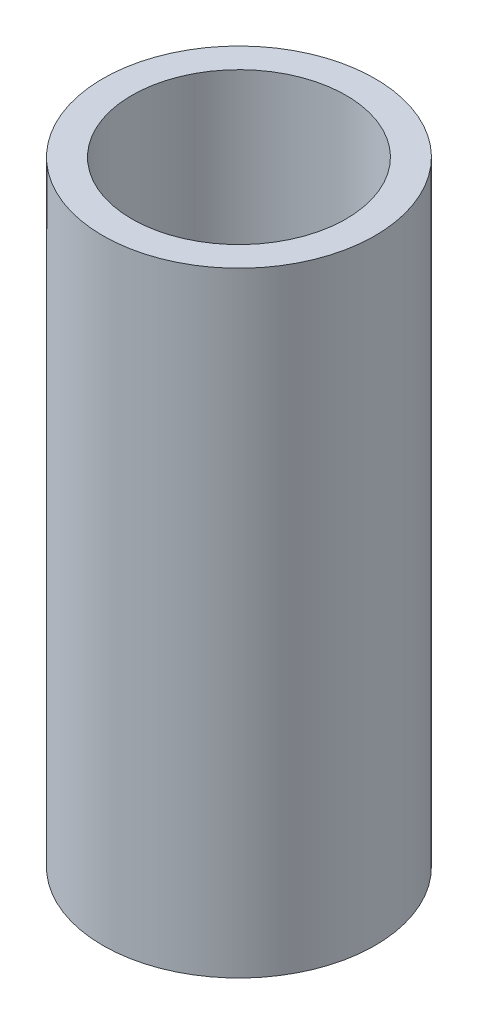
ISO-10303-21;
HEADER;
FILE_DESCRIPTION(('STEP AP214'),'2;1');
FILE_NAME('part.step','',(''),(''),'','','');
FILE_SCHEMA(('AUTOMOTIVE_DESIGN { 1 0 10303 214 1 1 1 1 }'));
ENDSEC;
DATA;
#1=APPLICATION_CONTEXT('core data for automotive mechanical design processes');
#2=APPLICATION_PROTOCOL_DEFINITION('international standard','automotive_design',2000,#1);
#3=PRODUCT_CONTEXT('',#1,'mechanical');
#4=PRODUCT('Part','Part','',(#3));
#5=PRODUCT_RELATED_PRODUCT_CATEGORY('part','',(#4));
#6=PRODUCT_DEFINITION_FORMATION('','',#4);
#7=PRODUCT_DEFINITION_CONTEXT('part definition',#1,'design');
#8=PRODUCT_DEFINITION('design','',#6,#7);
#9=PRODUCT_DEFINITION_SHAPE('','',#8);
#10=(LENGTH_UNIT() NAMED_UNIT(*) SI_UNIT(.MILLI.,.METRE.));
#11=(NAMED_UNIT(*) PLANE_ANGLE_UNIT() SI_UNIT($,.RADIAN.));
#12=(NAMED_UNIT(*) SI_UNIT($,.STERADIAN.) SOLID_ANGLE_UNIT());
#13=UNCERTAINTY_MEASURE_WITH_UNIT(LENGTH_MEASURE(1.E-05),#10,'distance_accuracy_value','');
#14=(GEOMETRIC_REPRESENTATION_CONTEXT(3) GLOBAL_UNCERTAINTY_ASSIGNED_CONTEXT((#13)) GLOBAL_UNIT_ASSIGNED_CONTEXT((#10,
#11,#12)) REPRESENTATION_CONTEXT('',''));
#15=CARTESIAN_POINT('',(0.,0.,0.));
#16=DIRECTION('',(0.,0.,1.));
#17=DIRECTION('',(1.,0.,0.));
#18=AXIS2_PLACEMENT_3D('',#15,#16,#17);
#19=CARTESIAN_POINT('',(0.,70.,0.));
#20=DIRECTION('',(0.,1.,0.));
#21=DIRECTION('',(0.,0.,1.));
#22=AXIS2_PLACEMENT_3D('',#19,#20,#21);
#23=PLANE('',#22);
#24=CARTESIAN_POINT('',(0.,70.,0.));
#25=DIRECTION('',(0.,1.,0.));
#26=DIRECTION('',(0.,0.,1.));
#27=AXIS2_PLACEMENT_3D('',#24,#25,#26);
#28=CIRCLE('',#27,15.5);
#29=CARTESIAN_POINT('',(0.,70.,15.5));
#30=VERTEX_POINT('',#29);
#31=EDGE_CURVE('E12',#30,#30,#28,.T.);
#32=ORIENTED_EDGE('',*,*,#31,.T.);
#33=EDGE_LOOP('',(#32));
#34=FACE_BOUND('',#33,.T.);
#35=CARTESIAN_POINT('',(0.,70.,0.));
#36=DIRECTION('',(0.,1.,0.));
#37=DIRECTION('',(0.,0.,1.));
#38=AXIS2_PLACEMENT_3D('',#35,#36,#37);
#39=CIRCLE('',#38,12.2);
#40=CARTESIAN_POINT('',(0.,70.,12.2));
#41=VERTEX_POINT('',#40);
#42=EDGE_CURVE('E62',#41,#41,#39,.T.);
#43=ORIENTED_EDGE('',*,*,#42,.F.);
#44=EDGE_LOOP('',(#43));
#45=FACE_BOUND('',#44,.T.);
#46=ADVANCED_FACE('F47',(#34,#45),#23,.T.);
#47=CARTESIAN_POINT('',(0.,0.,0.));
#48=DIRECTION('',(0.,1.,0.));
#49=DIRECTION('',(0.,0.,1.));
#50=AXIS2_PLACEMENT_3D('',#47,#48,#49);
#51=PLANE('',#50);
#52=CARTESIAN_POINT('',(0.,0.,0.));
#53=DIRECTION('',(0.,1.,0.));
#54=DIRECTION('',(0.,0.,1.));
#55=AXIS2_PLACEMENT_3D('',#52,#53,#54);
#56=CIRCLE('',#55,15.5);
#57=CARTESIAN_POINT('',(0.,0.,15.5));
#58=VERTEX_POINT('',#57);
#59=EDGE_CURVE('E51',#58,#58,#56,.T.);
#60=ORIENTED_EDGE('',*,*,#59,.F.);
#61=EDGE_LOOP('',(#60));
#62=FACE_BOUND('',#61,.T.);
#63=CARTESIAN_POINT('',(0.,0.,0.));
#64=DIRECTION('',(0.,1.,0.));
#65=DIRECTION('',(0.,0.,1.));
#66=AXIS2_PLACEMENT_3D('',#63,#64,#65);
#67=CIRCLE('',#66,12.2);
#68=CARTESIAN_POINT('',(0.,0.,12.2));
#69=VERTEX_POINT('',#68);
#70=EDGE_CURVE('E64',#69,#69,#67,.T.);
#71=ORIENTED_EDGE('',*,*,#70,.T.);
#72=EDGE_LOOP('',(#71));
#73=FACE_BOUND('',#72,.T.);
#74=ADVANCED_FACE('F74',(#62,#73),#51,.F.);
#75=CARTESIAN_POINT('',(0.,70.,0.));
#76=DIRECTION('',(0.,-1.,0.));
#77=DIRECTION('',(0.,0.,-1.));
#78=AXIS2_PLACEMENT_3D('',#75,#76,#77);
#79=CYLINDRICAL_SURFACE('',#78,15.5);
#80=ORIENTED_EDGE('',*,*,#31,.F.);
#81=EDGE_LOOP('',(#80));
#82=FACE_BOUND('',#81,.T.);
#83=ORIENTED_EDGE('',*,*,#59,.T.);
#84=EDGE_LOOP('',(#83));
#85=FACE_BOUND('',#84,.T.);
#86=ADVANCED_FACE('F49',(#82,#85),#79,.T.);
#87=CARTESIAN_POINT('',(0.,70.,0.));
#88=DIRECTION('',(0.,-1.,0.));
#89=DIRECTION('',(0.,0.,-1.));
#90=AXIS2_PLACEMENT_3D('',#87,#88,#89);
#91=CYLINDRICAL_SURFACE('',#90,12.2);
#92=ORIENTED_EDGE('',*,*,#42,.T.);
#93=EDGE_LOOP('',(#92));
#94=FACE_BOUND('',#93,.T.);
#95=ORIENTED_EDGE('',*,*,#70,.F.);
#96=EDGE_LOOP('',(#95));
#97=FACE_BOUND('',#96,.T.);
#98=ADVANCED_FACE('F70',(#94,#97),#91,.F.);
#99=CLOSED_SHELL('',(#46,#74,#86,#98));
#100=MANIFOLD_SOLID_BREP('B2',#99);
#101=ADVANCED_BREP_SHAPE_REPRESENTATION('',(#18,#100),#14);
#102=SHAPE_DEFINITION_REPRESENTATION(#9,#101);
ENDSEC;
END-ISO-10303-21;
